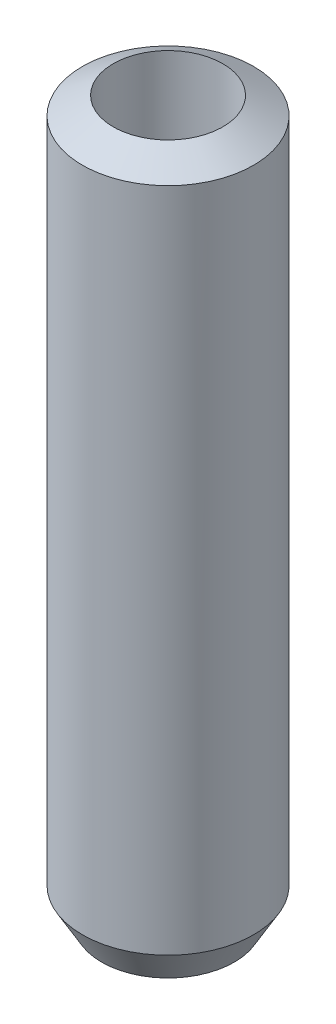
ISO-10303-21;
HEADER;
FILE_DESCRIPTION(('STEP AP214'),'2;1');
FILE_NAME('part.step','',(''),(''),'','','');
FILE_SCHEMA(('AUTOMOTIVE_DESIGN { 1 0 10303 214 1 1 1 1 }'));
ENDSEC;
DATA;
#1=APPLICATION_CONTEXT('core data for automotive mechanical design processes');
#2=APPLICATION_PROTOCOL_DEFINITION('international standard','automotive_design',2000,#1);
#3=PRODUCT_CONTEXT('',#1,'mechanical');
#4=PRODUCT('Part','Part','',(#3));
#5=PRODUCT_RELATED_PRODUCT_CATEGORY('part','',(#4));
#6=PRODUCT_DEFINITION_FORMATION('','',#4);
#7=PRODUCT_DEFINITION_CONTEXT('part definition',#1,'design');
#8=PRODUCT_DEFINITION('design','',#6,#7);
#9=PRODUCT_DEFINITION_SHAPE('','',#8);
#10=(LENGTH_UNIT() NAMED_UNIT(*) SI_UNIT(.MILLI.,.METRE.));
#11=(NAMED_UNIT(*) PLANE_ANGLE_UNIT() SI_UNIT($,.RADIAN.));
#12=(NAMED_UNIT(*) SI_UNIT($,.STERADIAN.) SOLID_ANGLE_UNIT());
#13=UNCERTAINTY_MEASURE_WITH_UNIT(LENGTH_MEASURE(1.E-05),#10,'distance_accuracy_value','');
#14=(GEOMETRIC_REPRESENTATION_CONTEXT(3) GLOBAL_UNCERTAINTY_ASSIGNED_CONTEXT((#13)) GLOBAL_UNIT_ASSIGNED_CONTEXT((#10,
#11,#12)) REPRESENTATION_CONTEXT('',''));
#15=CARTESIAN_POINT('',(0.,0.,0.));
#16=DIRECTION('',(0.,0.,1.));
#17=DIRECTION('',(1.,0.,0.));
#18=AXIS2_PLACEMENT_3D('',#15,#16,#17);
#19=CARTESIAN_POINT('',(0.,209.985929974804,0.));
#20=DIRECTION('',(0.,-1.,0.));
#21=DIRECTION('',(0.,0.,-1.));
#22=AXIS2_PLACEMENT_3D('',#19,#20,#21);
#23=CYLINDRICAL_SURFACE('',#22,25.);
#24=CARTESIAN_POINT('',(0.,204.36306979322,0.));
#25=DIRECTION('',(0.,1.,0.));
#26=DIRECTION('',(0.,0.,1.));
#27=AXIS2_PLACEMENT_3D('',#24,#25,#26);
#28=CIRCLE('',#27,25.);
#29=CARTESIAN_POINT('',(0.,204.36306979322,-25.));
#30=VERTEX_POINT('',#29);
#31=EDGE_CURVE('E50',#30,#30,#28,.F.);
#32=CARTESIAN_POINT('',(0.,9.73907951835973,0.));
#33=DIRECTION('',(0.,1.,0.));
#34=DIRECTION('',(0.,0.,1.));
#35=AXIS2_PLACEMENT_3D('',#32,#33,#34);
#36=CIRCLE('',#35,25.);
#37=CARTESIAN_POINT('',(0.,9.7390795183597,-25.));
#38=VERTEX_POINT('',#37);
#39=EDGE_CURVE('E51',#38,#38,#36,.T.);
#40=CARTESIAN_POINT('',(0.,204.36306979322,-25.));
#41=CARTESIAN_POINT('',(0.,202.335736561191,-25.));
#42=CARTESIAN_POINT('',(0.,200.308403329161,-25.));
#43=CARTESIAN_POINT('',(0.,196.253736865101,-25.));
#44=CARTESIAN_POINT('',(0.,194.226403633071,-25.));
#45=CARTESIAN_POINT('',(0.,190.171737169012,-25.));
#46=CARTESIAN_POINT('',(0.,188.144403936982,-25.));
#47=CARTESIAN_POINT('',(0.,184.089737472922,-25.));
#48=CARTESIAN_POINT('',(0.,182.062404240893,-25.));
#49=CARTESIAN_POINT('',(0.,178.007737776833,-25.));
#50=CARTESIAN_POINT('',(0.,175.980404544803,-25.));
#51=CARTESIAN_POINT('',(0.,171.925738080744,-25.));
#52=CARTESIAN_POINT('',(0.,169.898404848714,-25.));
#53=CARTESIAN_POINT('',(0.,165.843738384654,-25.));
#54=CARTESIAN_POINT('',(0.,163.816405152624,-25.));
#55=CARTESIAN_POINT('',(0.,159.761738688565,-25.));
#56=CARTESIAN_POINT('',(0.,157.734405456535,-25.));
#57=CARTESIAN_POINT('',(0.,153.679738992475,-25.));
#58=CARTESIAN_POINT('',(0.,151.652405760446,-25.));
#59=CARTESIAN_POINT('',(0.,147.597739296386,-25.));
#60=CARTESIAN_POINT('',(0.,145.570406064356,-25.));
#61=CARTESIAN_POINT('',(0.,141.515739600297,-25.));
#62=CARTESIAN_POINT('',(0.,139.488406368267,-25.));
#63=CARTESIAN_POINT('',(0.,135.433739904207,-25.));
#64=CARTESIAN_POINT('',(0.,133.406406672177,-25.));
#65=CARTESIAN_POINT('',(0.,129.351740208118,-25.));
#66=CARTESIAN_POINT('',(0.,127.324406976088,-25.));
#67=CARTESIAN_POINT('',(0.,123.269740512028,-25.));
#68=CARTESIAN_POINT('',(0.,121.242407279999,-25.));
#69=CARTESIAN_POINT('',(0.,117.187740815939,-25.));
#70=CARTESIAN_POINT('',(0.,115.160407583909,-25.));
#71=CARTESIAN_POINT('',(0.,111.10574111985,-25.));
#72=CARTESIAN_POINT('',(0.,109.07840788782,-25.));
#73=CARTESIAN_POINT('',(0.,105.02374142376,-25.));
#74=CARTESIAN_POINT('',(0.,102.99640819173,-25.));
#75=CARTESIAN_POINT('',(0.,98.9417417276709,-25.));
#76=CARTESIAN_POINT('',(0.,96.9144084956411,-25.));
#77=CARTESIAN_POINT('',(0.,92.8597420315815,-25.));
#78=CARTESIAN_POINT('',(0.,90.8324087995517,-25.));
#79=CARTESIAN_POINT('',(0.,86.7777423354921,-25.));
#80=CARTESIAN_POINT('',(0.,84.7504091034623,-25.));
#81=CARTESIAN_POINT('',(0.,80.6957426394027,-25.));
#82=CARTESIAN_POINT('',(0.,78.6684094073729,-25.));
#83=CARTESIAN_POINT('',(0.,74.6137429433133,-25.));
#84=CARTESIAN_POINT('',(0.,72.5864097112835,-25.));
#85=CARTESIAN_POINT('',(0.,68.5317432472239,-25.));
#86=CARTESIAN_POINT('',(0.,66.5044100151941,-25.));
#87=CARTESIAN_POINT('',(0.,62.4497435511345,-25.));
#88=CARTESIAN_POINT('',(0.,60.4224103191047,-25.));
#89=CARTESIAN_POINT('',(0.,56.3677438550451,-25.));
#90=CARTESIAN_POINT('',(0.,54.3404106230153,-25.));
#91=CARTESIAN_POINT('',(0.,50.2857441589557,-25.));
#92=CARTESIAN_POINT('',(0.,48.2584109269259,-25.));
#93=CARTESIAN_POINT('',(0.,44.2037444628663,-25.));
#94=CARTESIAN_POINT('',(0.,42.1764112308365,-25.));
#95=CARTESIAN_POINT('',(0.,38.1217447667769,-25.));
#96=CARTESIAN_POINT('',(0.,36.0944115347471,-25.));
#97=CARTESIAN_POINT('',(0.,32.0397450706875,-25.));
#98=CARTESIAN_POINT('',(0.,30.0124118386577,-25.));
#99=CARTESIAN_POINT('',(0.,25.9577453745981,-25.));
#100=CARTESIAN_POINT('',(0.,23.9304121425683,-25.));
#101=CARTESIAN_POINT('',(0.,19.8757456785087,-25.));
#102=CARTESIAN_POINT('',(0.,17.8484124464789,-25.));
#103=CARTESIAN_POINT('',(0.,13.7937459824193,-25.));
#104=CARTESIAN_POINT('',(0.,11.7664127503895,-25.));
#105=CARTESIAN_POINT('',(0.,9.7390795183597,-25.));
#106=B_SPLINE_CURVE_WITH_KNOTS('',3,(#40,#41,#42,#43,#44,#45,#46,#47,#48,#49,#50,#51,#52,#53,
#54,#55,#56,#57,#58,#59,#60,#61,#62,#63,#64,#65,#66,#67,#68,#69,#70,#71,#72,#73,#74,#75,#76,#77,
#78,#79,#80,#81,#82,#83,#84,#85,#86,#87,#88,#89,#90,#91,#92,#93,#94,#95,#96,#97,#98,#99,#100,
#101,#102,#103,#104,#105),.UNSPECIFIED.,.F.,.F.,(4,2,2,2,2,2,2,2,2,2,2,2,2,2,2,2,2,2,2,2,2,2,2,
2,2,2,2,2,2,2,2,2,4),(0.,6.08199969608941,12.1639993921788,18.2459990882682,24.3279987843576,
30.409998480447,36.4919981765364,42.5739978726258,48.6559975687152,54.7379972648046,
60.819996960894,66.9019966569834,72.9839963530728,79.0659960491622,85.1479957452516,
91.229995441341,97.3119951374304,103.39399483352,109.475994529609,115.557994225699,
121.639993921788,127.721993617877,133.803993313967,139.885993010056,145.967992706146,
152.049992402235,158.131992098324,164.213991794414,170.295991490503,176.377991186593,
182.459990882682,188.541990578771,194.623990274861),.UNSPECIFIED.);
#107=EDGE_CURVE('BSEAM39',#30,#38,#106,.T.);
#108=ORIENTED_EDGE('',*,*,#31,.T.);
#109=ORIENTED_EDGE('',*,*,#39,.T.);
#110=ORIENTED_EDGE('',*,*,#107,.T.);
#111=ORIENTED_EDGE('',*,*,#107,.F.);
#112=EDGE_LOOP('',(#108,#110,#109,#111));
#113=FACE_BOUND('',#112,.T.);
#114=ADVANCED_FACE('F39',(#113),#23,.T.);
#115=CARTESIAN_POINT('',(0.,0.,0.));
#116=DIRECTION('',(0.,1.,0.));
#117=DIRECTION('',(0.,0.,1.));
#118=AXIS2_PLACEMENT_3D('',#115,#116,#117);
#119=PLANE('',#118);
#120=CARTESIAN_POINT('',(0.,0.,0.));
#121=DIRECTION('',(0.,1.,0.));
#122=DIRECTION('',(0.,0.,1.));
#123=AXIS2_PLACEMENT_3D('',#120,#121,#122);
#124=CIRCLE('',#123,19.3771398184158);
#125=CARTESIAN_POINT('',(0.,0.,19.3771398184158));
#126=VERTEX_POINT('',#125);
#127=EDGE_CURVE('E10',#126,#126,#124,.F.);
#128=ORIENTED_EDGE('',*,*,#127,.T.);
#129=EDGE_LOOP('',(#128));
#130=FACE_BOUND('',#129,.T.);
#131=CARTESIAN_POINT('',(0.,0.,0.));
#132=DIRECTION('',(0.,1.,0.));
#133=DIRECTION('',(0.,0.,1.));
#134=AXIS2_PLACEMENT_3D('',#131,#132,#133);
#135=CIRCLE('',#134,15.9977561974088);
#136=CARTESIAN_POINT('',(0.,0.,-15.9977561974088));
#137=VERTEX_POINT('',#136);
#138=EDGE_CURVE('E58',#137,#137,#135,.T.);
#139=ORIENTED_EDGE('',*,*,#138,.T.);
#140=EDGE_LOOP('',(#139));
#141=FACE_BOUND('',#140,.T.);
#142=ADVANCED_FACE('F62',(#130,#141),#119,.F.);
#143=CARTESIAN_POINT('',(0.,209.985929974804,0.));
#144=DIRECTION('',(0.,-1.,0.));
#145=DIRECTION('',(0.,0.,-1.));
#146=AXIS2_PLACEMENT_3D('',#143,#144,#145);
#147=CYLINDRICAL_SURFACE('',#146,15.9977561974088);
#148=CARTESIAN_POINT('',(0.,209.560517675957,0.));
#149=DIRECTION('',(0.,-1.,0.));
#150=DIRECTION('',(0.,0.,-1.));
#151=AXIS2_PLACEMENT_3D('',#148,#149,#150);
#152=CIRCLE('',#151,15.9977561974088);
#153=CARTESIAN_POINT('',(0.,209.560517675957,-15.9977561974088));
#154=VERTEX_POINT('',#153);
#155=EDGE_CURVE('E54',#154,#154,#152,.F.);
#156=CARTESIAN_POINT('',(0.,209.560517675957,-15.9977561974088));
#157=CARTESIAN_POINT('',(0.,207.377595616833,-15.9977561974088));
#158=CARTESIAN_POINT('',(0.,205.194673557708,-15.9977561974088));
#159=CARTESIAN_POINT('',(0.,200.828829439459,-15.9977561974088));
#160=CARTESIAN_POINT('',(0.,198.645907380334,-15.9977561974088));
#161=CARTESIAN_POINT('',(0.,194.280063262085,-15.9977561974088));
#162=CARTESIAN_POINT('',(0.,192.097141202961,-15.9977561974088));
#163=CARTESIAN_POINT('',(0.,187.731297084712,-15.9977561974088));
#164=CARTESIAN_POINT('',(0.,185.548375025587,-15.9977561974088));
#165=CARTESIAN_POINT('',(0.,181.182530907338,-15.9977561974088));
#166=CARTESIAN_POINT('',(0.,178.999608848213,-15.9977561974088));
#167=CARTESIAN_POINT('',(0.,174.633764729964,-15.9977561974088));
#168=CARTESIAN_POINT('',(0.,172.45084267084,-15.9977561974088));
#169=CARTESIAN_POINT('',(0.,168.084998552591,-15.9977561974088));
#170=CARTESIAN_POINT('',(0.,165.902076493466,-15.9977561974088));
#171=CARTESIAN_POINT('',(0.,161.536232375217,-15.9977561974088));
#172=CARTESIAN_POINT('',(0.,159.353310316092,-15.9977561974088));
#173=CARTESIAN_POINT('',(0.,154.987466197843,-15.9977561974088));
#174=CARTESIAN_POINT('',(0.,152.804544138719,-15.9977561974088));
#175=CARTESIAN_POINT('',(0.,148.43870002047,-15.9977561974088));
#176=CARTESIAN_POINT('',(0.,146.255777961345,-15.9977561974088));
#177=CARTESIAN_POINT('',(0.,141.889933843096,-15.9977561974088));
#178=CARTESIAN_POINT('',(0.,139.707011783971,-15.9977561974088));
#179=CARTESIAN_POINT('',(0.,135.341167665722,-15.9977561974088));
#180=CARTESIAN_POINT('',(0.,133.158245606598,-15.9977561974088));
#181=CARTESIAN_POINT('',(0.,128.792401488349,-15.9977561974088));
#182=CARTESIAN_POINT('',(0.,126.609479429224,-15.9977561974088));
#183=CARTESIAN_POINT('',(0.,122.243635310975,-15.9977561974088));
#184=CARTESIAN_POINT('',(0.,120.06071325185,-15.9977561974088));
#185=CARTESIAN_POINT('',(0.,115.694869133601,-15.9977561974088));
#186=CARTESIAN_POINT('',(0.,113.511947074477,-15.9977561974088));
#187=CARTESIAN_POINT('',(0.,109.146102956228,-15.9977561974088));
#188=CARTESIAN_POINT('',(0.,106.963180897103,-15.9977561974088));
#189=CARTESIAN_POINT('',(0.,102.597336778854,-15.9977561974088));
#190=CARTESIAN_POINT('',(0.,100.414414719729,-15.9977561974088));
#191=CARTESIAN_POINT('',(0.,96.0485706014803,-15.9977561974088));
#192=CARTESIAN_POINT('',(0.,93.8656485423558,-15.9977561974088));
#193=CARTESIAN_POINT('',(0.,89.4998044241066,-15.9977561974088));
#194=CARTESIAN_POINT('',(0.,87.3168823649821,-15.9977561974088));
#195=CARTESIAN_POINT('',(0.,82.951038246733,-15.9977561974088));
#196=CARTESIAN_POINT('',(0.,80.7681161876084,-15.9977561974088));
#197=CARTESIAN_POINT('',(0.,76.4022720693593,-15.9977561974088));
#198=CARTESIAN_POINT('',(0.,74.2193500102348,-15.9977561974088));
#199=CARTESIAN_POINT('',(0.,69.8535058919857,-15.9977561974088));
#200=CARTESIAN_POINT('',(0.,67.6705838328611,-15.9977561974088));
#201=CARTESIAN_POINT('',(0.,63.304739714612,-15.9977561974088));
#202=CARTESIAN_POINT('',(0.,61.1218176554875,-15.9977561974088));
#203=CARTESIAN_POINT('',(0.,56.7559735372383,-15.9977561974088));
#204=CARTESIAN_POINT('',(0.,54.5730514781138,-15.9977561974088));
#205=CARTESIAN_POINT('',(0.,50.2072073598647,-15.9977561974088));
#206=CARTESIAN_POINT('',(0.,48.0242853007401,-15.9977561974088));
#207=CARTESIAN_POINT('',(0.,43.658441182491,-15.9977561974088));
#208=CARTESIAN_POINT('',(0.,41.4755191233665,-15.9977561974088));
#209=CARTESIAN_POINT('',(0.,37.1096750051174,-15.9977561974088));
#210=CARTESIAN_POINT('',(0.,34.9267529459928,-15.9977561974088));
#211=CARTESIAN_POINT('',(0.,30.5609088277437,-15.9977561974088));
#212=CARTESIAN_POINT('',(0.,28.3779867686192,-15.9977561974088));
#213=CARTESIAN_POINT('',(0.,24.0121426503701,-15.9977561974088));
#214=CARTESIAN_POINT('',(0.,21.8292205912455,-15.9977561974088));
#215=CARTESIAN_POINT('',(0.,17.4633764729964,-15.9977561974088));
#216=CARTESIAN_POINT('',(0.,15.2804544138718,-15.9977561974088));
#217=CARTESIAN_POINT('',(0.,10.9146102956227,-15.9977561974088));
#218=CARTESIAN_POINT('',(0.,8.73168823649818,-15.9977561974088));
#219=CARTESIAN_POINT('',(0.,4.36584411824908,-15.9977561974088));
#220=CARTESIAN_POINT('',(0.,2.18292205912453,-15.9977561974088));
#221=CARTESIAN_POINT('',(0.,0.,-15.9977561974088));
#222=B_SPLINE_CURVE_WITH_KNOTS('',3,(#156,#157,#158,#159,#160,#161,#162,#163,#164,#165,#166,
#167,#168,#169,#170,#171,#172,#173,#174,#175,#176,#177,#178,#179,#180,#181,#182,#183,#184,#185,
#186,#187,#188,#189,#190,#191,#192,#193,#194,#195,#196,#197,#198,#199,#200,#201,#202,#203,#204,
#205,#206,#207,#208,#209,#210,#211,#212,#213,#214,#215,#216,#217,#218,#219,#220,#221),
.UNSPECIFIED.,.F.,.F.,(4,2,2,2,2,2,2,2,2,2,2,2,2,2,2,2,2,2,2,2,2,2,2,2,2,2,2,2,2,2,2,2,4),(0.,
6.54876617737365,13.0975323547473,19.646298532121,26.1950647094946,32.7438308868683,
39.2925970642419,45.8413632416156,52.3901294189893,58.9388955963629,65.4876617737366,
72.0364279511102,78.5851941284839,85.1339603058575,91.6827264832312,98.2314926606049,
104.780258837979,111.329025015352,117.877791192726,124.4265573701,130.975323547473,
137.524089724847,144.07285590222,150.621622079594,157.170388256968,163.719154434341,
170.267920611715,176.816686789089,183.365452966462,189.914219143836,196.46298532121,
203.011751498583,209.560517675957),.UNSPECIFIED.);
#223=EDGE_CURVE('BSEAM68',#154,#137,#222,.T.);
#224=ORIENTED_EDGE('',*,*,#155,.T.);
#225=ORIENTED_EDGE('',*,*,#138,.F.);
#226=ORIENTED_EDGE('',*,*,#223,.T.);
#227=ORIENTED_EDGE('',*,*,#223,.F.);
#228=EDGE_LOOP('',(#224,#226,#225,#227));
#229=FACE_BOUND('',#228,.T.);
#230=ADVANCED_FACE('F68',(#229),#147,.F.);
#231=CARTESIAN_POINT('',(0.,209.985929974804,0.));
#232=DIRECTION('',(0.,-1.,0.));
#233=DIRECTION('',(0.,0.,-1.));
#234=AXIS2_PLACEMENT_3D('',#231,#232,#233);
#235=CONICAL_SURFACE('',#234,15.2609204816405,1.0471975511966);
#236=CARTESIAN_POINT('',(0.,204.36306979322,-25.));
#237=CARTESIAN_POINT('',(0.,204.417209875332,-24.9062266270564));
#238=CARTESIAN_POINT('',(0.,204.471349957444,-24.8124532541127));
#239=CARTESIAN_POINT('',(0.,204.579630121668,-24.6249065082254));
#240=CARTESIAN_POINT('',(0.,204.63377020378,-24.5311331352817));
#241=CARTESIAN_POINT('',(0.,204.742050368003,-24.3435863893944));
#242=CARTESIAN_POINT('',(0.,204.796190450115,-24.2498130164508));
#243=CARTESIAN_POINT('',(0.,204.904470614339,-24.0622662705634));
#244=CARTESIAN_POINT('',(0.,204.958610696451,-23.9684928976198));
#245=CARTESIAN_POINT('',(0.,205.066890860674,-23.7809461517325));
#246=CARTESIAN_POINT('',(0.,205.121030942786,-23.6871727787888));
#247=CARTESIAN_POINT('',(0.,205.22931110701,-23.4996260329015));
#248=CARTESIAN_POINT('',(0.,205.283451189122,-23.4058526599578));
#249=CARTESIAN_POINT('',(0.,205.391731353345,-23.2183059140705));
#250=CARTESIAN_POINT('',(0.,205.445871435457,-23.1245325411269));
#251=CARTESIAN_POINT('',(0.,205.554151599681,-22.9369857952395));
#252=CARTESIAN_POINT('',(0.,205.608291681793,-22.8432124222959));
#253=CARTESIAN_POINT('',(0.,205.716571846016,-22.6556656764086));
#254=CARTESIAN_POINT('',(0.,205.770711928128,-22.5618923034649));
#255=CARTESIAN_POINT('',(0.,205.878992092352,-22.3743455575776));
#256=CARTESIAN_POINT('',(0.,205.933132174464,-22.2805721846339));
#257=CARTESIAN_POINT('',(0.,206.041412338687,-22.0930254387466));
#258=CARTESIAN_POINT('',(0.,206.095552420799,-21.999252065803));
#259=CARTESIAN_POINT('',(0.,206.203832585023,-21.8117053199156));
#260=CARTESIAN_POINT('',(0.,206.257972667135,-21.717931946972));
#261=CARTESIAN_POINT('',(0.,206.366252831358,-21.5303852010847));
#262=CARTESIAN_POINT('',(0.,206.42039291347,-21.436611828141));
#263=CARTESIAN_POINT('',(0.,206.528673077694,-21.2490650822537));
#264=CARTESIAN_POINT('',(0.,206.582813159806,-21.15529170931));
#265=CARTESIAN_POINT('',(0.,206.69109332403,-20.9677449634227));
#266=CARTESIAN_POINT('',(0.,206.745233406141,-20.8739715904791));
#267=CARTESIAN_POINT('',(0.,206.853513570365,-20.6864248445917));
#268=CARTESIAN_POINT('',(0.,206.907653652477,-20.5926514716481));
#269=CARTESIAN_POINT('',(0.,207.015933816701,-20.4051047257608));
#270=CARTESIAN_POINT('',(0.,207.070073898812,-20.3113313528171));
#271=CARTESIAN_POINT('',(0.,207.178354063036,-20.1237846069298));
#272=CARTESIAN_POINT('',(0.,207.232494145148,-20.0300112339861));
#273=CARTESIAN_POINT('',(0.,207.340774309372,-19.8424644880988));
#274=CARTESIAN_POINT('',(0.,207.394914391483,-19.7486911151552));
#275=CARTESIAN_POINT('',(0.,207.503194555707,-19.5611443692678));
#276=CARTESIAN_POINT('',(0.,207.557334637819,-19.4673709963242));
#277=CARTESIAN_POINT('',(0.,207.665614802043,-19.2798242504369));
#278=CARTESIAN_POINT('',(0.,207.719754884154,-19.1860508774932));
#279=CARTESIAN_POINT('',(0.,207.828035048378,-18.9985041316059));
#280=CARTESIAN_POINT('',(0.,207.88217513049,-18.9047307586622));
#281=CARTESIAN_POINT('',(0.,207.990455294714,-18.7171840127749));
#282=CARTESIAN_POINT('',(0.,208.044595376826,-18.6234106398313));
#283=CARTESIAN_POINT('',(0.,208.152875541049,-18.4358638939439));
#284=CARTESIAN_POINT('',(0.,208.207015623161,-18.3420905210003));
#285=CARTESIAN_POINT('',(0.,208.315295787385,-18.154543775113));
#286=CARTESIAN_POINT('',(0.,208.369435869497,-18.0607704021693));
#287=CARTESIAN_POINT('',(0.,208.47771603372,-17.873223656282));
#288=CARTESIAN_POINT('',(0.,208.531856115832,-17.7794502833383));
#289=CARTESIAN_POINT('',(0.,208.640136280056,-17.591903537451));
#290=CARTESIAN_POINT('',(0.,208.694276362168,-17.4981301645074));
#291=CARTESIAN_POINT('',(0.,208.802556526391,-17.31058341862));
#292=CARTESIAN_POINT('',(0.,208.856696608503,-17.2168100456764));
#293=CARTESIAN_POINT('',(0.,208.964976772727,-17.0292632997891));
#294=CARTESIAN_POINT('',(0.,209.019116854839,-16.9354899268454));
#295=CARTESIAN_POINT('',(0.,209.127397019062,-16.7479431809581));
#296=CARTESIAN_POINT('',(0.,209.181537101174,-16.6541698080144));
#297=CARTESIAN_POINT('',(0.,209.289817265398,-16.4666230621271));
#298=CARTESIAN_POINT('',(0.,209.34395734751,-16.3728496891835));
#299=CARTESIAN_POINT('',(0.,209.452237511733,-16.1853029432961));
#300=CARTESIAN_POINT('',(0.,209.506377593845,-16.0915295703525));
#301=CARTESIAN_POINT('',(0.,209.560517675957,-15.9977561974088));
#302=B_SPLINE_CURVE_WITH_KNOTS('',3,(#236,#237,#238,#239,#240,#241,#242,#243,#244,#245,#246,
#247,#248,#249,#250,#251,#252,#253,#254,#255,#256,#257,#258,#259,#260,#261,#262,#263,#264,#265,
#266,#267,#268,#269,#270,#271,#272,#273,#274,#275,#276,#277,#278,#279,#280,#281,#282,#283,#284,
#285,#286,#287,#288,#289,#290,#291,#292,#293,#294,#295,#296,#297,#298,#299,#300,#301),
.UNSPECIFIED.,.F.,.F.,(4,2,2,2,2,2,2,2,2,2,2,2,2,2,2,2,2,2,2,2,2,2,2,2,2,2,2,2,2,2,2,2,4),(0.,
0.324840492671036,0.649680985342083,0.974521478013116,1.29936197068416,1.62420246335521,
1.94904295602624,2.27388344869729,2.59872394136832,2.92356443403937,3.2484049267104,
3.57324541938145,3.8980859120525,4.22292640472353,4.54776689739458,4.87260739006561,
5.19744788273666,5.52228837540771,5.84712886807874,6.17196936074979,6.49680985342082,
6.82165034609187,7.14649083876292,7.47133133143395,7.796171824105,8.12101231677603,
8.44585280944708,8.77069330211813,9.09553379478916,9.42037428746021,9.74521478013124,
10.0700552728023,10.3948957654733),.UNSPECIFIED.);
#303=EDGE_CURVE('BSEAM66',#30,#154,#302,.T.);
#304=ORIENTED_EDGE('',*,*,#31,.F.);
#305=ORIENTED_EDGE('',*,*,#155,.F.);
#306=ORIENTED_EDGE('',*,*,#303,.T.);
#307=ORIENTED_EDGE('',*,*,#303,.F.);
#308=EDGE_LOOP('',(#304,#306,#305,#307));
#309=FACE_BOUND('',#308,.T.);
#310=ADVANCED_FACE('F66',(#309),#235,.T.);
#311=CARTESIAN_POINT('',(0.,9.73907951835973,0.));
#312=DIRECTION('',(0.,1.,0.));
#313=DIRECTION('',(0.,0.,1.));
#314=AXIS2_PLACEMENT_3D('',#311,#312,#313);
#315=CONICAL_SURFACE('',#314,25.,0.523598775598303);
#316=ORIENTED_EDGE('',*,*,#127,.F.);
#317=EDGE_LOOP('',(#316));
#318=FACE_BOUND('',#317,.T.);
#319=ORIENTED_EDGE('',*,*,#39,.F.);
#320=EDGE_LOOP('',(#319));
#321=FACE_BOUND('',#320,.T.);
#322=ADVANCED_FACE('F45',(#318,#321),#315,.T.);
#323=CLOSED_SHELL('',(#114,#142,#230,#310,#322));
#324=MANIFOLD_SOLID_BREP('B2',#323);
#325=ADVANCED_BREP_SHAPE_REPRESENTATION('',(#18,#324),#14);
#326=SHAPE_DEFINITION_REPRESENTATION(#9,#325);
ENDSEC;
END-ISO-10303-21;
